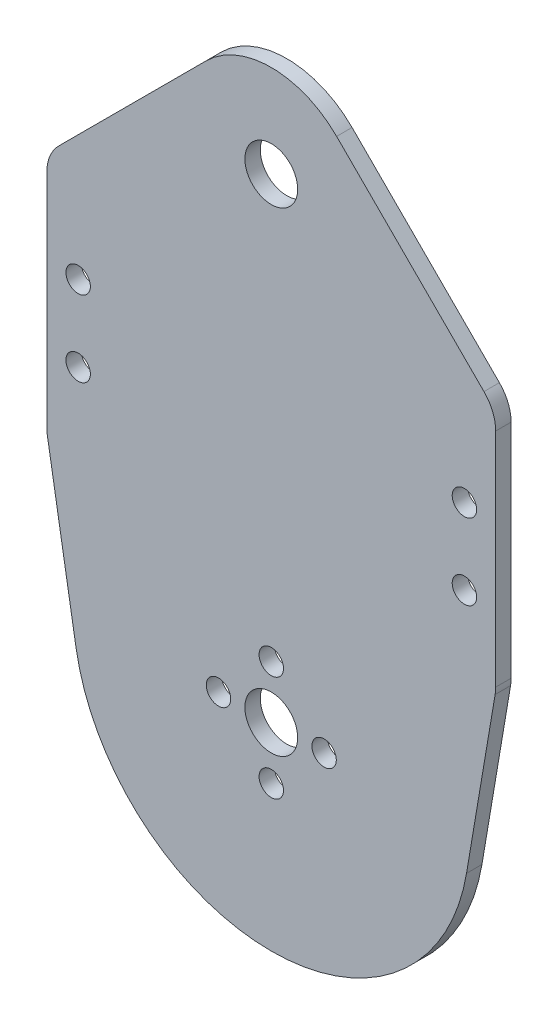
ISO-10303-21;
HEADER;
FILE_DESCRIPTION(('STEP AP214'),'2;1');
FILE_NAME('part.step','',(''),(''),'','','');
FILE_SCHEMA(('AUTOMOTIVE_DESIGN { 1 0 10303 214 1 1 1 1 }'));
ENDSEC;
DATA;
#1=APPLICATION_CONTEXT('core data for automotive mechanical design processes');
#2=APPLICATION_PROTOCOL_DEFINITION('international standard','automotive_design',2000,#1);
#3=PRODUCT_CONTEXT('',#1,'mechanical');
#4=PRODUCT('Part','Part','',(#3));
#5=PRODUCT_RELATED_PRODUCT_CATEGORY('part','',(#4));
#6=PRODUCT_DEFINITION_FORMATION('','',#4);
#7=PRODUCT_DEFINITION_CONTEXT('part definition',#1,'design');
#8=PRODUCT_DEFINITION('design','',#6,#7);
#9=PRODUCT_DEFINITION_SHAPE('','',#8);
#10=(LENGTH_UNIT() NAMED_UNIT(*) SI_UNIT(.MILLI.,.METRE.));
#11=(NAMED_UNIT(*) PLANE_ANGLE_UNIT() SI_UNIT($,.RADIAN.));
#12=(NAMED_UNIT(*) SI_UNIT($,.STERADIAN.) SOLID_ANGLE_UNIT());
#13=UNCERTAINTY_MEASURE_WITH_UNIT(LENGTH_MEASURE(1.E-05),#10,'distance_accuracy_value','');
#14=(GEOMETRIC_REPRESENTATION_CONTEXT(3) GLOBAL_UNCERTAINTY_ASSIGNED_CONTEXT((#13)) GLOBAL_UNIT_ASSIGNED_CONTEXT((#10,
#11,#12)) REPRESENTATION_CONTEXT('',''));
#15=CARTESIAN_POINT('',(0.,0.,0.));
#16=DIRECTION('',(0.,0.,1.));
#17=DIRECTION('',(1.,0.,0.));
#18=AXIS2_PLACEMENT_3D('',#15,#16,#17);
#19=CARTESIAN_POINT('',(-27.936254688423,55.2473043263916,2.3368));
#20=DIRECTION('',(0.,0.,1.));
#21=DIRECTION('',(1.,0.,0.));
#22=AXIS2_PLACEMENT_3D('',#19,#20,#21);
#23=PLANE('',#22);
#24=CARTESIAN_POINT('',(-29.2625000000001,43.5,2.3368));
#25=DIRECTION('',(0.,0.,1.));
#26=DIRECTION('',(1.,0.,0.));
#27=AXIS2_PLACEMENT_3D('',#24,#25,#26);
#28=CIRCLE('',#27,1.85);
#29=CARTESIAN_POINT('',(-27.4125000000001,43.5,2.3368));
#30=VERTEX_POINT('',#29);
#31=EDGE_CURVE('E315',#30,#30,#28,.T.);
#32=ORIENTED_EDGE('',*,*,#31,.F.);
#33=EDGE_LOOP('',(#32));
#34=FACE_BOUND('',#33,.T.);
#35=CARTESIAN_POINT('',(29.2625,32.,2.3368));
#36=DIRECTION('',(0.,0.,1.));
#37=DIRECTION('',(1.,0.,0.));
#38=AXIS2_PLACEMENT_3D('',#35,#36,#37);
#39=CIRCLE('',#38,1.85);
#40=CARTESIAN_POINT('',(31.1125000000001,32.,2.3368));
#41=VERTEX_POINT('',#40);
#42=EDGE_CURVE('E327',#41,#41,#39,.T.);
#43=ORIENTED_EDGE('',*,*,#42,.F.);
#44=EDGE_LOOP('',(#43));
#45=FACE_BOUND('',#44,.T.);
#46=CARTESIAN_POINT('',(0.,-8.,2.3368));
#47=DIRECTION('',(0.,0.,1.));
#48=DIRECTION('',(1.,0.,0.));
#49=AXIS2_PLACEMENT_3D('',#46,#47,#48);
#50=CIRCLE('',#49,1.85);
#51=CARTESIAN_POINT('',(1.85,-8.,2.3368));
#52=VERTEX_POINT('',#51);
#53=EDGE_CURVE('E339',#52,#52,#50,.T.);
#54=ORIENTED_EDGE('',*,*,#53,.F.);
#55=EDGE_LOOP('',(#54));
#56=FACE_BOUND('',#55,.T.);
#57=CARTESIAN_POINT('',(0.,8.,2.3368));
#58=DIRECTION('',(0.,0.,1.));
#59=DIRECTION('',(1.,0.,0.));
#60=AXIS2_PLACEMENT_3D('',#57,#58,#59);
#61=CIRCLE('',#60,1.85);
#62=CARTESIAN_POINT('',(1.85,8.,2.3368));
#63=VERTEX_POINT('',#62);
#64=EDGE_CURVE('E351',#63,#63,#61,.T.);
#65=ORIENTED_EDGE('',*,*,#64,.F.);
#66=EDGE_LOOP('',(#65));
#67=FACE_BOUND('',#66,.T.);
#68=CARTESIAN_POINT('',(29.2625000000001,43.5,2.3368));
#69=DIRECTION('',(0.,0.,1.));
#70=DIRECTION('',(1.,0.,0.));
#71=AXIS2_PLACEMENT_3D('',#68,#69,#70);
#72=CIRCLE('',#71,1.85);
#73=CARTESIAN_POINT('',(31.1125000000001,43.5,2.3368));
#74=VERTEX_POINT('',#73);
#75=EDGE_CURVE('E158',#74,#74,#72,.T.);
#76=ORIENTED_EDGE('',*,*,#75,.F.);
#77=EDGE_LOOP('',(#76));
#78=FACE_BOUND('',#77,.T.);
#79=CARTESIAN_POINT('',(-27.936254688423,55.2473043263916,2.3368));
#80=DIRECTION('',(0.,0.,1.));
#81=DIRECTION('',(1.,0.,0.));
#82=AXIS2_PLACEMENT_3D('',#79,#80,#81);
#83=CIRCLE('',#82,6.06374531157693);
#84=CARTESIAN_POINT('',(-32.2239701176272,59.5350197555958,2.3368));
#85=VERTEX_POINT('',#84);
#86=CARTESIAN_POINT('',(-33.9999999999999,55.2473043263916,2.3368));
#87=VERTEX_POINT('',#86);
#88=EDGE_CURVE('E177',#85,#87,#83,.T.);
#89=ORIENTED_EDGE('',*,*,#88,.T.);
#90=DIRECTION('',(0.,-1.,0.));
#91=VECTOR('',#90,1.);
#92=CARTESIAN_POINT('',(-34.,21.6405384480173,2.3368));
#93=LINE('',#92,#91);
#94=CARTESIAN_POINT('',(-34.,21.6405384480173,2.3368));
#95=VERTEX_POINT('',#94);
#96=EDGE_CURVE('E105',#87,#95,#93,.T.);
#97=ORIENTED_EDGE('',*,*,#96,.T.);
#98=CARTESIAN_POINT('',(-27.936254688423,21.6405384480173,2.3368));
#99=DIRECTION('',(0.,0.,1.));
#100=DIRECTION('',(1.,0.,0.));
#101=AXIS2_PLACEMENT_3D('',#98,#99,#100);
#102=CIRCLE('',#101,6.06374531157696);
#103=CARTESIAN_POINT('',(-33.9150906830899,20.6293375023359,2.3368));
#104=VERTEX_POINT('',#103);
#105=EDGE_CURVE('E204',#95,#104,#102,.T.);
#106=ORIENTED_EDGE('',*,*,#105,.T.);
#107=DIRECTION('',(0.166761777370622,-0.985997215821724,0.));
#108=VECTOR('',#107,1.);
#109=CARTESIAN_POINT('',(-29.5799164746517,-5.00285332111866,2.3368));
#110=LINE('',#109,#108);
#111=CARTESIAN_POINT('',(-29.5799164746517,-5.00285332111866,2.3368));
#112=VERTEX_POINT('',#111);
#113=EDGE_CURVE('E223',#104,#112,#110,.T.);
#114=ORIENTED_EDGE('',*,*,#113,.T.);
#115=CARTESIAN_POINT('',(0.,0.,2.3368));
#116=DIRECTION('',(0.,0.,1.));
#117=DIRECTION('',(1.,0.,0.));
#118=AXIS2_PLACEMENT_3D('',#115,#116,#117);
#119=CIRCLE('',#118,30.);
#120=CARTESIAN_POINT('',(29.5799164746517,-5.00285332111875,2.3368));
#121=VERTEX_POINT('',#120);
#122=EDGE_CURVE('E220',#112,#121,#119,.T.);
#123=ORIENTED_EDGE('',*,*,#122,.T.);
#124=DIRECTION('',(0.166761777370625,0.985997215821723,0.));
#125=VECTOR('',#124,1.);
#126=CARTESIAN_POINT('',(29.5799164746517,-5.00285332111874,2.3368));
#127=LINE('',#126,#125);
#128=CARTESIAN_POINT('',(33.91509068309,20.6293375023359,2.3368));
#129=VERTEX_POINT('',#128);
#130=EDGE_CURVE('E222',#121,#129,#127,.T.);
#131=ORIENTED_EDGE('',*,*,#130,.T.);
#132=CARTESIAN_POINT('',(27.9362546884231,21.6405384480172,2.3368));
#133=DIRECTION('',(0.,0.,1.));
#134=DIRECTION('',(1.,0.,0.));
#135=AXIS2_PLACEMENT_3D('',#132,#133,#134);
#136=CIRCLE('',#135,6.06374531157695);
#137=CARTESIAN_POINT('',(34.,21.6405384480172,2.3368));
#138=VERTEX_POINT('',#137);
#139=EDGE_CURVE('E225',#129,#138,#136,.T.);
#140=ORIENTED_EDGE('',*,*,#139,.T.);
#141=DIRECTION('',(0.,1.,0.));
#142=VECTOR('',#141,1.);
#143=CARTESIAN_POINT('',(34.,21.6405384480172,2.3368));
#144=LINE('',#143,#142);
#145=CARTESIAN_POINT('',(34.0000000000001,55.2473043263916,2.3368));
#146=VERTEX_POINT('',#145);
#147=EDGE_CURVE('E231',#138,#146,#144,.T.);
#148=ORIENTED_EDGE('',*,*,#147,.T.);
#149=CARTESIAN_POINT('',(27.9362546884231,55.2473043263916,2.3368));
#150=DIRECTION('',(0.,0.,1.));
#151=DIRECTION('',(1.,0.,0.));
#152=AXIS2_PLACEMENT_3D('',#149,#150,#151);
#153=CIRCLE('',#152,6.06374531157696);
#154=CARTESIAN_POINT('',(32.2239701176273,59.5350197555958,2.3368));
#155=VERTEX_POINT('',#154);
#156=EDGE_CURVE('E136',#146,#155,#153,.T.);
#157=ORIENTED_EDGE('',*,*,#156,.T.);
#158=DIRECTION('',(-0.707106781186544,0.707106781186551,0.));
#159=VECTOR('',#158,1.);
#160=CARTESIAN_POINT('',(32.2239701176273,59.5350197555958,2.3368));
#161=LINE('',#160,#159);
#162=CARTESIAN_POINT('',(9.89949493661178,81.8594949366116,2.3368));
#163=VERTEX_POINT('',#162);
#164=EDGE_CURVE('E130',#155,#163,#161,.T.);
#165=ORIENTED_EDGE('',*,*,#164,.T.);
#166=CARTESIAN_POINT('',(0.,71.96,2.3368));
#167=DIRECTION('',(0.,0.,1.));
#168=DIRECTION('',(1.,0.,0.));
#169=AXIS2_PLACEMENT_3D('',#166,#167,#168);
#170=CIRCLE('',#169,14.);
#171=CARTESIAN_POINT('',(-9.89949493661165,81.8594949366116,2.3368));
#172=VERTEX_POINT('',#171);
#173=EDGE_CURVE('E134',#163,#172,#170,.T.);
#174=ORIENTED_EDGE('',*,*,#173,.T.);
#175=DIRECTION('',(-0.707106781186544,-0.707106781186551,0.));
#176=VECTOR('',#175,1.);
#177=CARTESIAN_POINT('',(-9.89949493661165,81.8594949366116,2.3368));
#178=LINE('',#177,#176);
#179=EDGE_CURVE('E50',#172,#85,#178,.T.);
#180=ORIENTED_EDGE('',*,*,#179,.T.);
#181=EDGE_LOOP('',(#89,#97,#106,#114,#123,#131,#140,#148,#157,#165,#174,#180));
#182=FACE_BOUND('',#181,.T.);
#183=CARTESIAN_POINT('',(0.,0.,2.3368));
#184=DIRECTION('',(0.,0.,1.));
#185=DIRECTION('',(1.,0.,0.));
#186=AXIS2_PLACEMENT_3D('',#183,#184,#185);
#187=CIRCLE('',#186,4.);
#188=CARTESIAN_POINT('',(4.,0.,2.3368));
#189=VERTEX_POINT('',#188);
#190=EDGE_CURVE('E357',#189,#189,#187,.T.);
#191=ORIENTED_EDGE('',*,*,#190,.F.);
#192=EDGE_LOOP('',(#191));
#193=FACE_BOUND('',#192,.T.);
#194=CARTESIAN_POINT('',(-8.,0.,2.3368));
#195=DIRECTION('',(0.,0.,1.));
#196=DIRECTION('',(1.,0.,0.));
#197=AXIS2_PLACEMENT_3D('',#194,#195,#196);
#198=CIRCLE('',#197,1.85);
#199=CARTESIAN_POINT('',(-6.15,0.,2.3368));
#200=VERTEX_POINT('',#199);
#201=EDGE_CURVE('E345',#200,#200,#198,.T.);
#202=ORIENTED_EDGE('',*,*,#201,.F.);
#203=EDGE_LOOP('',(#202));
#204=FACE_BOUND('',#203,.T.);
#205=CARTESIAN_POINT('',(8.,0.,2.3368));
#206=DIRECTION('',(0.,0.,1.));
#207=DIRECTION('',(1.,0.,0.));
#208=AXIS2_PLACEMENT_3D('',#205,#206,#207);
#209=CIRCLE('',#208,1.85);
#210=CARTESIAN_POINT('',(9.85,0.,2.3368));
#211=VERTEX_POINT('',#210);
#212=EDGE_CURVE('E333',#211,#211,#209,.T.);
#213=ORIENTED_EDGE('',*,*,#212,.F.);
#214=EDGE_LOOP('',(#213));
#215=FACE_BOUND('',#214,.T.);
#216=CARTESIAN_POINT('',(0.,71.96,2.3368));
#217=DIRECTION('',(0.,0.,1.));
#218=DIRECTION('',(1.,0.,0.));
#219=AXIS2_PLACEMENT_3D('',#216,#217,#218);
#220=CIRCLE('',#219,4.);
#221=CARTESIAN_POINT('',(4.00000000000005,71.96,2.3368));
#222=VERTEX_POINT('',#221);
#223=EDGE_CURVE('E321',#222,#222,#220,.T.);
#224=ORIENTED_EDGE('',*,*,#223,.F.);
#225=EDGE_LOOP('',(#224));
#226=FACE_BOUND('',#225,.T.);
#227=CARTESIAN_POINT('',(-29.2625000000001,32.,2.3368));
#228=DIRECTION('',(0.,0.,1.));
#229=DIRECTION('',(1.,0.,0.));
#230=AXIS2_PLACEMENT_3D('',#227,#228,#229);
#231=CIRCLE('',#230,1.85);
#232=CARTESIAN_POINT('',(-27.4125000000001,32.,2.3368));
#233=VERTEX_POINT('',#232);
#234=EDGE_CURVE('E306',#233,#233,#231,.T.);
#235=ORIENTED_EDGE('',*,*,#234,.F.);
#236=EDGE_LOOP('',(#235));
#237=FACE_BOUND('',#236,.T.);
#238=ADVANCED_FACE('F33',(#34,#45,#56,#67,#78,#182,#193,#204,#215,#226,#237),#23,.T.);
#239=CARTESIAN_POINT('',(-27.936254688423,55.2473043263916,0.));
#240=DIRECTION('',(0.,0.,1.));
#241=DIRECTION('',(1.,0.,0.));
#242=AXIS2_PLACEMENT_3D('',#239,#240,#241);
#243=PLANE('',#242);
#244=CARTESIAN_POINT('',(-27.936254688423,55.2473043263916,0.));
#245=DIRECTION('',(0.,0.,1.));
#246=DIRECTION('',(1.,0.,0.));
#247=AXIS2_PLACEMENT_3D('',#244,#245,#246);
#248=CIRCLE('',#247,6.06374531157693);
#249=CARTESIAN_POINT('',(-32.2239701176272,59.5350197555958,0.));
#250=VERTEX_POINT('',#249);
#251=CARTESIAN_POINT('',(-33.9999999999999,55.2473043263916,0.));
#252=VERTEX_POINT('',#251);
#253=EDGE_CURVE('E154',#250,#252,#248,.T.);
#254=ORIENTED_EDGE('',*,*,#253,.F.);
#255=DIRECTION('',(-0.707106781186544,-0.707106781186551,0.));
#256=VECTOR('',#255,1.);
#257=CARTESIAN_POINT('',(-9.89949493661165,81.8594949366116,0.));
#258=LINE('',#257,#256);
#259=CARTESIAN_POINT('',(-9.89949493661165,81.8594949366116,0.));
#260=VERTEX_POINT('',#259);
#261=EDGE_CURVE('E97',#260,#250,#258,.T.);
#262=ORIENTED_EDGE('',*,*,#261,.F.);
#263=CARTESIAN_POINT('',(0.,71.96,0.));
#264=DIRECTION('',(0.,0.,1.));
#265=DIRECTION('',(1.,0.,0.));
#266=AXIS2_PLACEMENT_3D('',#263,#264,#265);
#267=CIRCLE('',#266,14.);
#268=CARTESIAN_POINT('',(9.89949493661178,81.8594949366116,0.));
#269=VERTEX_POINT('',#268);
#270=EDGE_CURVE('E91',#269,#260,#267,.T.);
#271=ORIENTED_EDGE('',*,*,#270,.F.);
#272=DIRECTION('',(-0.707106781186544,0.707106781186551,0.));
#273=VECTOR('',#272,1.);
#274=CARTESIAN_POINT('',(32.2239701176273,59.5350197555958,0.));
#275=LINE('',#274,#273);
#276=CARTESIAN_POINT('',(32.2239701176273,59.5350197555958,0.));
#277=VERTEX_POINT('',#276);
#278=EDGE_CURVE('E144',#277,#269,#275,.T.);
#279=ORIENTED_EDGE('',*,*,#278,.F.);
#280=CARTESIAN_POINT('',(27.9362546884231,55.2473043263916,0.));
#281=DIRECTION('',(0.,0.,1.));
#282=DIRECTION('',(1.,0.,0.));
#283=AXIS2_PLACEMENT_3D('',#280,#281,#282);
#284=CIRCLE('',#283,6.06374531157696);
#285=CARTESIAN_POINT('',(34.0000000000001,55.2473043263916,0.));
#286=VERTEX_POINT('',#285);
#287=EDGE_CURVE('E172',#286,#277,#284,.T.);
#288=ORIENTED_EDGE('',*,*,#287,.F.);
#289=DIRECTION('',(0.,1.,0.));
#290=VECTOR('',#289,1.);
#291=CARTESIAN_POINT('',(34.,21.6405384480172,0.));
#292=LINE('',#291,#290);
#293=CARTESIAN_POINT('',(34.,21.6405384480172,0.));
#294=VERTEX_POINT('',#293);
#295=EDGE_CURVE('E170',#294,#286,#292,.T.);
#296=ORIENTED_EDGE('',*,*,#295,.F.);
#297=CARTESIAN_POINT('',(27.9362546884231,21.6405384480172,0.));
#298=DIRECTION('',(0.,0.,1.));
#299=DIRECTION('',(1.,0.,0.));
#300=AXIS2_PLACEMENT_3D('',#297,#298,#299);
#301=CIRCLE('',#300,6.06374531157695);
#302=CARTESIAN_POINT('',(33.91509068309,20.6293375023359,0.));
#303=VERTEX_POINT('',#302);
#304=EDGE_CURVE('E168',#303,#294,#301,.T.);
#305=ORIENTED_EDGE('',*,*,#304,.F.);
#306=DIRECTION('',(0.166761777370625,0.985997215821723,0.));
#307=VECTOR('',#306,1.);
#308=CARTESIAN_POINT('',(29.5799164746517,-5.00285332111874,0.));
#309=LINE('',#308,#307);
#310=CARTESIAN_POINT('',(29.5799164746517,-5.00285332111875,0.));
#311=VERTEX_POINT('',#310);
#312=EDGE_CURVE('E166',#311,#303,#309,.T.);
#313=ORIENTED_EDGE('',*,*,#312,.F.);
#314=CARTESIAN_POINT('',(0.,0.,0.));
#315=DIRECTION('',(0.,0.,1.));
#316=DIRECTION('',(1.,0.,0.));
#317=AXIS2_PLACEMENT_3D('',#314,#315,#316);
#318=CIRCLE('',#317,30.);
#319=CARTESIAN_POINT('',(-29.5799164746517,-5.00285332111866,0.));
#320=VERTEX_POINT('',#319);
#321=EDGE_CURVE('E164',#320,#311,#318,.T.);
#322=ORIENTED_EDGE('',*,*,#321,.F.);
#323=DIRECTION('',(0.166761777370622,-0.985997215821724,0.));
#324=VECTOR('',#323,1.);
#325=CARTESIAN_POINT('',(-29.5799164746517,-5.00285332111866,0.));
#326=LINE('',#325,#324);
#327=CARTESIAN_POINT('',(-33.9150906830899,20.6293375023359,0.));
#328=VERTEX_POINT('',#327);
#329=EDGE_CURVE('E162',#328,#320,#326,.T.);
#330=ORIENTED_EDGE('',*,*,#329,.F.);
#331=CARTESIAN_POINT('',(-27.936254688423,21.6405384480173,0.));
#332=DIRECTION('',(0.,0.,1.));
#333=DIRECTION('',(1.,0.,0.));
#334=AXIS2_PLACEMENT_3D('',#331,#332,#333);
#335=CIRCLE('',#334,6.06374531157696);
#336=CARTESIAN_POINT('',(-34.,21.6405384480173,0.));
#337=VERTEX_POINT('',#336);
#338=EDGE_CURVE('E160',#337,#328,#335,.T.);
#339=ORIENTED_EDGE('',*,*,#338,.F.);
#340=DIRECTION('',(0.,-1.,0.));
#341=VECTOR('',#340,1.);
#342=CARTESIAN_POINT('',(-34.,21.6405384480173,0.));
#343=LINE('',#342,#341);
#344=EDGE_CURVE('E157',#252,#337,#343,.T.);
#345=ORIENTED_EDGE('',*,*,#344,.F.);
#346=EDGE_LOOP('',(#254,#262,#271,#279,#288,#296,#305,#313,#322,#330,#339,#345));
#347=FACE_BOUND('',#346,.T.);
#348=CARTESIAN_POINT('',(29.2625000000001,43.5,0.));
#349=DIRECTION('',(0.,0.,1.));
#350=DIRECTION('',(1.,0.,0.));
#351=AXIS2_PLACEMENT_3D('',#348,#349,#350);
#352=CIRCLE('',#351,1.85);
#353=CARTESIAN_POINT('',(31.1125000000001,43.5,0.));
#354=VERTEX_POINT('',#353);
#355=EDGE_CURVE('E360',#354,#354,#352,.T.);
#356=ORIENTED_EDGE('',*,*,#355,.T.);
#357=EDGE_LOOP('',(#356));
#358=FACE_BOUND('',#357,.T.);
#359=CARTESIAN_POINT('',(0.,0.,0.));
#360=DIRECTION('',(0.,0.,1.));
#361=DIRECTION('',(1.,0.,0.));
#362=AXIS2_PLACEMENT_3D('',#359,#360,#361);
#363=CIRCLE('',#362,4.);
#364=CARTESIAN_POINT('',(4.,0.,0.));
#365=VERTEX_POINT('',#364);
#366=EDGE_CURVE('E354',#365,#365,#363,.T.);
#367=ORIENTED_EDGE('',*,*,#366,.T.);
#368=EDGE_LOOP('',(#367));
#369=FACE_BOUND('',#368,.T.);
#370=CARTESIAN_POINT('',(0.,8.,0.));
#371=DIRECTION('',(0.,0.,1.));
#372=DIRECTION('',(1.,0.,0.));
#373=AXIS2_PLACEMENT_3D('',#370,#371,#372);
#374=CIRCLE('',#373,1.85);
#375=CARTESIAN_POINT('',(1.85,8.,0.));
#376=VERTEX_POINT('',#375);
#377=EDGE_CURVE('E348',#376,#376,#374,.T.);
#378=ORIENTED_EDGE('',*,*,#377,.T.);
#379=EDGE_LOOP('',(#378));
#380=FACE_BOUND('',#379,.T.);
#381=CARTESIAN_POINT('',(-8.,0.,0.));
#382=DIRECTION('',(0.,0.,1.));
#383=DIRECTION('',(1.,0.,0.));
#384=AXIS2_PLACEMENT_3D('',#381,#382,#383);
#385=CIRCLE('',#384,1.85);
#386=CARTESIAN_POINT('',(-6.15,0.,0.));
#387=VERTEX_POINT('',#386);
#388=EDGE_CURVE('E342',#387,#387,#385,.T.);
#389=ORIENTED_EDGE('',*,*,#388,.T.);
#390=EDGE_LOOP('',(#389));
#391=FACE_BOUND('',#390,.T.);
#392=CARTESIAN_POINT('',(0.,-8.,0.));
#393=DIRECTION('',(0.,0.,1.));
#394=DIRECTION('',(1.,0.,0.));
#395=AXIS2_PLACEMENT_3D('',#392,#393,#394);
#396=CIRCLE('',#395,1.85);
#397=CARTESIAN_POINT('',(1.85,-8.,0.));
#398=VERTEX_POINT('',#397);
#399=EDGE_CURVE('E336',#398,#398,#396,.T.);
#400=ORIENTED_EDGE('',*,*,#399,.T.);
#401=EDGE_LOOP('',(#400));
#402=FACE_BOUND('',#401,.T.);
#403=CARTESIAN_POINT('',(8.,0.,0.));
#404=DIRECTION('',(0.,0.,1.));
#405=DIRECTION('',(1.,0.,0.));
#406=AXIS2_PLACEMENT_3D('',#403,#404,#405);
#407=CIRCLE('',#406,1.85);
#408=CARTESIAN_POINT('',(9.85,0.,0.));
#409=VERTEX_POINT('',#408);
#410=EDGE_CURVE('E330',#409,#409,#407,.T.);
#411=ORIENTED_EDGE('',*,*,#410,.T.);
#412=EDGE_LOOP('',(#411));
#413=FACE_BOUND('',#412,.T.);
#414=CARTESIAN_POINT('',(29.2625,32.,0.));
#415=DIRECTION('',(0.,0.,1.));
#416=DIRECTION('',(1.,0.,0.));
#417=AXIS2_PLACEMENT_3D('',#414,#415,#416);
#418=CIRCLE('',#417,1.85);
#419=CARTESIAN_POINT('',(31.1125000000001,32.,0.));
#420=VERTEX_POINT('',#419);
#421=EDGE_CURVE('E324',#420,#420,#418,.T.);
#422=ORIENTED_EDGE('',*,*,#421,.T.);
#423=EDGE_LOOP('',(#422));
#424=FACE_BOUND('',#423,.T.);
#425=CARTESIAN_POINT('',(0.,71.96,0.));
#426=DIRECTION('',(0.,0.,1.));
#427=DIRECTION('',(1.,0.,0.));
#428=AXIS2_PLACEMENT_3D('',#425,#426,#427);
#429=CIRCLE('',#428,4.);
#430=CARTESIAN_POINT('',(4.00000000000005,71.96,0.));
#431=VERTEX_POINT('',#430);
#432=EDGE_CURVE('E318',#431,#431,#429,.T.);
#433=ORIENTED_EDGE('',*,*,#432,.T.);
#434=EDGE_LOOP('',(#433));
#435=FACE_BOUND('',#434,.T.);
#436=CARTESIAN_POINT('',(-29.2625000000001,43.5,0.));
#437=DIRECTION('',(0.,0.,1.));
#438=DIRECTION('',(1.,0.,0.));
#439=AXIS2_PLACEMENT_3D('',#436,#437,#438);
#440=CIRCLE('',#439,1.85);
#441=CARTESIAN_POINT('',(-27.4125000000001,43.5,0.));
#442=VERTEX_POINT('',#441);
#443=EDGE_CURVE('E312',#442,#442,#440,.T.);
#444=ORIENTED_EDGE('',*,*,#443,.T.);
#445=EDGE_LOOP('',(#444));
#446=FACE_BOUND('',#445,.T.);
#447=CARTESIAN_POINT('',(-29.2625000000001,32.,0.));
#448=DIRECTION('',(0.,0.,1.));
#449=DIRECTION('',(1.,0.,0.));
#450=AXIS2_PLACEMENT_3D('',#447,#448,#449);
#451=CIRCLE('',#450,1.85);
#452=CARTESIAN_POINT('',(-27.4125000000001,32.,0.));
#453=VERTEX_POINT('',#452);
#454=EDGE_CURVE('E309',#453,#453,#451,.T.);
#455=ORIENTED_EDGE('',*,*,#454,.T.);
#456=EDGE_LOOP('',(#455));
#457=FACE_BOUND('',#456,.T.);
#458=ADVANCED_FACE('F208',(#347,#358,#369,#380,#391,#402,#413,#424,#435,#446,#457),#243,.F.);
#459=CARTESIAN_POINT('',(-27.936254688423,55.2473043263916,2.3368));
#460=DIRECTION('',(0.,0.,-1.));
#461=DIRECTION('',(-1.,0.,0.));
#462=AXIS2_PLACEMENT_3D('',#459,#460,#461);
#463=CYLINDRICAL_SURFACE('',#462,6.06374531157693);
#464=ORIENTED_EDGE('',*,*,#253,.T.);
#465=DIRECTION('',(0.,0.,-1.));
#466=VECTOR('',#465,1.);
#467=CARTESIAN_POINT('',(-33.9999999999999,55.2473043263916,2.3368));
#468=LINE('',#467,#466);
#469=EDGE_CURVE('E11',#87,#252,#468,.T.);
#470=ORIENTED_EDGE('',*,*,#469,.F.);
#471=ORIENTED_EDGE('',*,*,#88,.F.);
#472=DIRECTION('',(0.,0.,-1.));
#473=VECTOR('',#472,1.);
#474=CARTESIAN_POINT('',(-32.2239701176272,59.5350197555958,2.3368));
#475=LINE('',#474,#473);
#476=EDGE_CURVE('E150',#85,#250,#475,.T.);
#477=ORIENTED_EDGE('',*,*,#476,.T.);
#478=EDGE_LOOP('',(#464,#470,#471,#477));
#479=FACE_BOUND('',#478,.T.);
#480=ADVANCED_FACE('F35',(#479),#463,.T.);
#481=CARTESIAN_POINT('',(-34.,21.6405384480173,2.3368));
#482=DIRECTION('',(1.,0.,0.));
#483=DIRECTION('',(0.,1.,0.));
#484=AXIS2_PLACEMENT_3D('',#481,#482,#483);
#485=PLANE('',#484);
#486=ORIENTED_EDGE('',*,*,#344,.T.);
#487=DIRECTION('',(0.,0.,-1.));
#488=VECTOR('',#487,1.);
#489=CARTESIAN_POINT('',(-34.,21.6405384480173,2.3368));
#490=LINE('',#489,#488);
#491=EDGE_CURVE('E42',#95,#337,#490,.T.);
#492=ORIENTED_EDGE('',*,*,#491,.F.);
#493=ORIENTED_EDGE('',*,*,#96,.F.);
#494=ORIENTED_EDGE('',*,*,#469,.T.);
#495=EDGE_LOOP('',(#486,#492,#493,#494));
#496=FACE_BOUND('',#495,.T.);
#497=ADVANCED_FACE('F524',(#496),#485,.F.);
#498=CARTESIAN_POINT('',(-27.936254688423,21.6405384480173,2.3368));
#499=DIRECTION('',(0.,0.,-1.));
#500=DIRECTION('',(-1.,0.,0.));
#501=AXIS2_PLACEMENT_3D('',#498,#499,#500);
#502=CYLINDRICAL_SURFACE('',#501,6.06374531157696);
#503=ORIENTED_EDGE('',*,*,#338,.T.);
#504=DIRECTION('',(0.,0.,-1.));
#505=VECTOR('',#504,1.);
#506=CARTESIAN_POINT('',(-33.9150906830899,20.6293375023359,2.3368));
#507=LINE('',#506,#505);
#508=EDGE_CURVE('E196',#104,#328,#507,.T.);
#509=ORIENTED_EDGE('',*,*,#508,.F.);
#510=ORIENTED_EDGE('',*,*,#105,.F.);
#511=ORIENTED_EDGE('',*,*,#491,.T.);
#512=EDGE_LOOP('',(#503,#509,#510,#511));
#513=FACE_BOUND('',#512,.T.);
#514=ADVANCED_FACE('F202',(#513),#502,.T.);
#515=CARTESIAN_POINT('',(-29.5799164746517,-5.00285332111866,2.3368));
#516=DIRECTION('',(0.985997215821724,0.166761777370622,0.));
#517=DIRECTION('',(-0.166761777370622,0.985997215821724,0.));
#518=AXIS2_PLACEMENT_3D('',#515,#516,#517);
#519=PLANE('',#518);
#520=ORIENTED_EDGE('',*,*,#329,.T.);
#521=DIRECTION('',(0.,0.,-1.));
#522=VECTOR('',#521,1.);
#523=CARTESIAN_POINT('',(-29.5799164746517,-5.00285332111866,2.3368));
#524=LINE('',#523,#522);
#525=EDGE_CURVE('E193',#112,#320,#524,.T.);
#526=ORIENTED_EDGE('',*,*,#525,.F.);
#527=ORIENTED_EDGE('',*,*,#113,.F.);
#528=ORIENTED_EDGE('',*,*,#508,.T.);
#529=EDGE_LOOP('',(#520,#526,#527,#528));
#530=FACE_BOUND('',#529,.T.);
#531=ADVANCED_FACE('F214',(#530),#519,.F.);
#532=CARTESIAN_POINT('',(0.,0.,2.3368));
#533=DIRECTION('',(0.,0.,-1.));
#534=DIRECTION('',(-1.,0.,0.));
#535=AXIS2_PLACEMENT_3D('',#532,#533,#534);
#536=CYLINDRICAL_SURFACE('',#535,30.);
#537=ORIENTED_EDGE('',*,*,#321,.T.);
#538=DIRECTION('',(0.,0.,-1.));
#539=VECTOR('',#538,1.);
#540=CARTESIAN_POINT('',(29.5799164746517,-5.00285332111875,2.3368));
#541=LINE('',#540,#539);
#542=EDGE_CURVE('E190',#121,#311,#541,.T.);
#543=ORIENTED_EDGE('',*,*,#542,.F.);
#544=ORIENTED_EDGE('',*,*,#122,.F.);
#545=ORIENTED_EDGE('',*,*,#525,.T.);
#546=EDGE_LOOP('',(#537,#543,#544,#545));
#547=FACE_BOUND('',#546,.T.);
#548=ADVANCED_FACE('F218',(#547),#536,.T.);
#549=CARTESIAN_POINT('',(29.5799164746517,-5.00285332111874,2.3368));
#550=DIRECTION('',(-0.985997215821724,0.166761777370625,0.));
#551=DIRECTION('',(-0.166761777370625,-0.985997215821724,0.));
#552=AXIS2_PLACEMENT_3D('',#549,#550,#551);
#553=PLANE('',#552);
#554=ORIENTED_EDGE('',*,*,#312,.T.);
#555=DIRECTION('',(0.,0.,-1.));
#556=VECTOR('',#555,1.);
#557=CARTESIAN_POINT('',(33.91509068309,20.6293375023359,2.3368));
#558=LINE('',#557,#556);
#559=EDGE_CURVE('E187',#129,#303,#558,.T.);
#560=ORIENTED_EDGE('',*,*,#559,.F.);
#561=ORIENTED_EDGE('',*,*,#130,.F.);
#562=ORIENTED_EDGE('',*,*,#542,.T.);
#563=EDGE_LOOP('',(#554,#560,#561,#562));
#564=FACE_BOUND('',#563,.T.);
#565=ADVANCED_FACE('F489',(#564),#553,.F.);
#566=CARTESIAN_POINT('',(27.9362546884231,21.6405384480172,2.3368));
#567=DIRECTION('',(0.,0.,-1.));
#568=DIRECTION('',(-1.,0.,0.));
#569=AXIS2_PLACEMENT_3D('',#566,#567,#568);
#570=CYLINDRICAL_SURFACE('',#569,6.06374531157695);
#571=ORIENTED_EDGE('',*,*,#304,.T.);
#572=DIRECTION('',(0.,0.,-1.));
#573=VECTOR('',#572,1.);
#574=CARTESIAN_POINT('',(34.,21.6405384480172,2.3368));
#575=LINE('',#574,#573);
#576=EDGE_CURVE('E184',#138,#294,#575,.T.);
#577=ORIENTED_EDGE('',*,*,#576,.F.);
#578=ORIENTED_EDGE('',*,*,#139,.F.);
#579=ORIENTED_EDGE('',*,*,#559,.T.);
#580=EDGE_LOOP('',(#571,#577,#578,#579));
#581=FACE_BOUND('',#580,.T.);
#582=ADVANCED_FACE('F480',(#581),#570,.T.);
#583=CARTESIAN_POINT('',(34.,21.6405384480172,2.3368));
#584=DIRECTION('',(-1.,0.,0.));
#585=DIRECTION('',(0.,-1.,0.));
#586=AXIS2_PLACEMENT_3D('',#583,#584,#585);
#587=PLANE('',#586);
#588=ORIENTED_EDGE('',*,*,#295,.T.);
#589=DIRECTION('',(0.,0.,-1.));
#590=VECTOR('',#589,1.);
#591=CARTESIAN_POINT('',(34.0000000000001,55.2473043263916,2.3368));
#592=LINE('',#591,#590);
#593=EDGE_CURVE('E181',#146,#286,#592,.T.);
#594=ORIENTED_EDGE('',*,*,#593,.F.);
#595=ORIENTED_EDGE('',*,*,#147,.F.);
#596=ORIENTED_EDGE('',*,*,#576,.T.);
#597=EDGE_LOOP('',(#588,#594,#595,#596));
#598=FACE_BOUND('',#597,.T.);
#599=ADVANCED_FACE('F237',(#598),#587,.F.);
#600=CARTESIAN_POINT('',(27.9362546884231,55.2473043263916,2.3368));
#601=DIRECTION('',(0.,0.,-1.));
#602=DIRECTION('',(-1.,0.,0.));
#603=AXIS2_PLACEMENT_3D('',#600,#601,#602);
#604=CYLINDRICAL_SURFACE('',#603,6.06374531157696);
#605=ORIENTED_EDGE('',*,*,#287,.T.);
#606=DIRECTION('',(0.,0.,-1.));
#607=VECTOR('',#606,1.);
#608=CARTESIAN_POINT('',(32.2239701176273,59.5350197555958,2.3368));
#609=LINE('',#608,#607);
#610=EDGE_CURVE('E145',#155,#277,#609,.T.);
#611=ORIENTED_EDGE('',*,*,#610,.F.);
#612=ORIENTED_EDGE('',*,*,#156,.F.);
#613=ORIENTED_EDGE('',*,*,#593,.T.);
#614=EDGE_LOOP('',(#605,#611,#612,#613));
#615=FACE_BOUND('',#614,.T.);
#616=ADVANCED_FACE('F241',(#615),#604,.T.);
#617=CARTESIAN_POINT('',(32.2239701176273,59.5350197555958,2.3368));
#618=DIRECTION('',(-0.707106781186551,-0.707106781186544,0.));
#619=DIRECTION('',(0.707106781186544,-0.707106781186551,0.));
#620=AXIS2_PLACEMENT_3D('',#617,#618,#619);
#621=PLANE('',#620);
#622=ORIENTED_EDGE('',*,*,#278,.T.);
#623=DIRECTION('',(0.,0.,-1.));
#624=VECTOR('',#623,1.);
#625=CARTESIAN_POINT('',(9.89949493661178,81.8594949366116,2.3368));
#626=LINE('',#625,#624);
#627=EDGE_CURVE('E141',#163,#269,#626,.T.);
#628=ORIENTED_EDGE('',*,*,#627,.F.);
#629=ORIENTED_EDGE('',*,*,#164,.F.);
#630=ORIENTED_EDGE('',*,*,#610,.T.);
#631=EDGE_LOOP('',(#622,#628,#629,#630));
#632=FACE_BOUND('',#631,.T.);
#633=ADVANCED_FACE('F142',(#632),#621,.F.);
#634=CARTESIAN_POINT('',(0.,71.96,2.3368));
#635=DIRECTION('',(0.,0.,-1.));
#636=DIRECTION('',(-1.,0.,0.));
#637=AXIS2_PLACEMENT_3D('',#634,#635,#636);
#638=CYLINDRICAL_SURFACE('',#637,14.);
#639=ORIENTED_EDGE('',*,*,#270,.T.);
#640=DIRECTION('',(0.,0.,-1.));
#641=VECTOR('',#640,1.);
#642=CARTESIAN_POINT('',(-9.89949493661165,81.8594949366116,2.3368));
#643=LINE('',#642,#641);
#644=EDGE_CURVE('E146',#172,#260,#643,.T.);
#645=ORIENTED_EDGE('',*,*,#644,.F.);
#646=ORIENTED_EDGE('',*,*,#173,.F.);
#647=ORIENTED_EDGE('',*,*,#627,.T.);
#648=EDGE_LOOP('',(#639,#645,#646,#647));
#649=FACE_BOUND('',#648,.T.);
#650=ADVANCED_FACE('F148',(#649),#638,.T.);
#651=CARTESIAN_POINT('',(-9.89949493661165,81.8594949366116,2.3368));
#652=DIRECTION('',(0.707106781186551,-0.707106781186544,0.));
#653=DIRECTION('',(0.707106781186544,0.707106781186551,0.));
#654=AXIS2_PLACEMENT_3D('',#651,#652,#653);
#655=PLANE('',#654);
#656=ORIENTED_EDGE('',*,*,#261,.T.);
#657=ORIENTED_EDGE('',*,*,#476,.F.);
#658=ORIENTED_EDGE('',*,*,#179,.F.);
#659=ORIENTED_EDGE('',*,*,#644,.T.);
#660=EDGE_LOOP('',(#656,#657,#658,#659));
#661=FACE_BOUND('',#660,.T.);
#662=ADVANCED_FACE('F245',(#661),#655,.F.);
#663=CARTESIAN_POINT('',(29.2625000000001,43.5,2.3368));
#664=DIRECTION('',(0.,0.,-1.));
#665=DIRECTION('',(-1.,0.,0.));
#666=AXIS2_PLACEMENT_3D('',#663,#664,#665);
#667=CYLINDRICAL_SURFACE('',#666,1.85);
#668=ORIENTED_EDGE('',*,*,#75,.T.);
#669=EDGE_LOOP('',(#668));
#670=FACE_BOUND('',#669,.T.);
#671=ORIENTED_EDGE('',*,*,#355,.F.);
#672=EDGE_LOOP('',(#671));
#673=FACE_BOUND('',#672,.T.);
#674=ADVANCED_FACE('F247',(#670,#673),#667,.F.);
#675=CARTESIAN_POINT('',(0.,0.,2.3368));
#676=DIRECTION('',(0.,0.,-1.));
#677=DIRECTION('',(-1.,0.,0.));
#678=AXIS2_PLACEMENT_3D('',#675,#676,#677);
#679=CYLINDRICAL_SURFACE('',#678,4.);
#680=ORIENTED_EDGE('',*,*,#190,.T.);
#681=EDGE_LOOP('',(#680));
#682=FACE_BOUND('',#681,.T.);
#683=ORIENTED_EDGE('',*,*,#366,.F.);
#684=EDGE_LOOP('',(#683));
#685=FACE_BOUND('',#684,.T.);
#686=ADVANCED_FACE('F253',(#682,#685),#679,.F.);
#687=CARTESIAN_POINT('',(0.,8.,2.3368));
#688=DIRECTION('',(0.,0.,-1.));
#689=DIRECTION('',(-1.,0.,0.));
#690=AXIS2_PLACEMENT_3D('',#687,#688,#689);
#691=CYLINDRICAL_SURFACE('',#690,1.85);
#692=ORIENTED_EDGE('',*,*,#64,.T.);
#693=EDGE_LOOP('',(#692));
#694=FACE_BOUND('',#693,.T.);
#695=ORIENTED_EDGE('',*,*,#377,.F.);
#696=EDGE_LOOP('',(#695));
#697=FACE_BOUND('',#696,.T.);
#698=ADVANCED_FACE('F269',(#694,#697),#691,.F.);
#699=CARTESIAN_POINT('',(-8.,0.,2.3368));
#700=DIRECTION('',(0.,0.,-1.));
#701=DIRECTION('',(-1.,0.,0.));
#702=AXIS2_PLACEMENT_3D('',#699,#700,#701);
#703=CYLINDRICAL_SURFACE('',#702,1.85);
#704=ORIENTED_EDGE('',*,*,#201,.T.);
#705=EDGE_LOOP('',(#704));
#706=FACE_BOUND('',#705,.T.);
#707=ORIENTED_EDGE('',*,*,#388,.F.);
#708=EDGE_LOOP('',(#707));
#709=FACE_BOUND('',#708,.T.);
#710=ADVANCED_FACE('F273',(#706,#709),#703,.F.);
#711=CARTESIAN_POINT('',(0.,-8.,2.3368));
#712=DIRECTION('',(0.,0.,-1.));
#713=DIRECTION('',(-1.,0.,0.));
#714=AXIS2_PLACEMENT_3D('',#711,#712,#713);
#715=CYLINDRICAL_SURFACE('',#714,1.85);
#716=ORIENTED_EDGE('',*,*,#53,.T.);
#717=EDGE_LOOP('',(#716));
#718=FACE_BOUND('',#717,.T.);
#719=ORIENTED_EDGE('',*,*,#399,.F.);
#720=EDGE_LOOP('',(#719));
#721=FACE_BOUND('',#720,.T.);
#722=ADVANCED_FACE('F277',(#718,#721),#715,.F.);
#723=CARTESIAN_POINT('',(8.,0.,2.3368));
#724=DIRECTION('',(0.,0.,-1.));
#725=DIRECTION('',(-1.,0.,0.));
#726=AXIS2_PLACEMENT_3D('',#723,#724,#725);
#727=CYLINDRICAL_SURFACE('',#726,1.85);
#728=ORIENTED_EDGE('',*,*,#212,.T.);
#729=EDGE_LOOP('',(#728));
#730=FACE_BOUND('',#729,.T.);
#731=ORIENTED_EDGE('',*,*,#410,.F.);
#732=EDGE_LOOP('',(#731));
#733=FACE_BOUND('',#732,.T.);
#734=ADVANCED_FACE('F281',(#730,#733),#727,.F.);
#735=CARTESIAN_POINT('',(29.2625,32.,2.3368));
#736=DIRECTION('',(0.,0.,-1.));
#737=DIRECTION('',(-1.,0.,0.));
#738=AXIS2_PLACEMENT_3D('',#735,#736,#737);
#739=CYLINDRICAL_SURFACE('',#738,1.85);
#740=ORIENTED_EDGE('',*,*,#42,.T.);
#741=EDGE_LOOP('',(#740));
#742=FACE_BOUND('',#741,.T.);
#743=ORIENTED_EDGE('',*,*,#421,.F.);
#744=EDGE_LOOP('',(#743));
#745=FACE_BOUND('',#744,.T.);
#746=ADVANCED_FACE('F285',(#742,#745),#739,.F.);
#747=CARTESIAN_POINT('',(0.,71.96,2.3368));
#748=DIRECTION('',(0.,0.,-1.));
#749=DIRECTION('',(-1.,0.,0.));
#750=AXIS2_PLACEMENT_3D('',#747,#748,#749);
#751=CYLINDRICAL_SURFACE('',#750,4.);
#752=ORIENTED_EDGE('',*,*,#223,.T.);
#753=EDGE_LOOP('',(#752));
#754=FACE_BOUND('',#753,.T.);
#755=ORIENTED_EDGE('',*,*,#432,.F.);
#756=EDGE_LOOP('',(#755));
#757=FACE_BOUND('',#756,.T.);
#758=ADVANCED_FACE('F289',(#754,#757),#751,.F.);
#759=CARTESIAN_POINT('',(-29.2625000000001,43.5,2.3368));
#760=DIRECTION('',(0.,0.,-1.));
#761=DIRECTION('',(-1.,0.,0.));
#762=AXIS2_PLACEMENT_3D('',#759,#760,#761);
#763=CYLINDRICAL_SURFACE('',#762,1.85);
#764=ORIENTED_EDGE('',*,*,#31,.T.);
#765=EDGE_LOOP('',(#764));
#766=FACE_BOUND('',#765,.T.);
#767=ORIENTED_EDGE('',*,*,#443,.F.);
#768=EDGE_LOOP('',(#767));
#769=FACE_BOUND('',#768,.T.);
#770=ADVANCED_FACE('F293',(#766,#769),#763,.F.);
#771=CARTESIAN_POINT('',(-29.2625000000001,32.,2.3368));
#772=DIRECTION('',(0.,0.,-1.));
#773=DIRECTION('',(-1.,0.,0.));
#774=AXIS2_PLACEMENT_3D('',#771,#772,#773);
#775=CYLINDRICAL_SURFACE('',#774,1.85);
#776=ORIENTED_EDGE('',*,*,#234,.T.);
#777=EDGE_LOOP('',(#776));
#778=FACE_BOUND('',#777,.T.);
#779=ORIENTED_EDGE('',*,*,#454,.F.);
#780=EDGE_LOOP('',(#779));
#781=FACE_BOUND('',#780,.T.);
#782=ADVANCED_FACE('F297',(#778,#781),#775,.F.);
#783=CLOSED_SHELL('',(#238,#458,#480,#497,#514,#531,#548,#565,#582,#599,#616,#633,#650,#662,
#674,#686,#698,#710,#722,#734,#746,#758,#770,#782));
#784=MANIFOLD_SOLID_BREP('B2',#783);
#785=ADVANCED_BREP_SHAPE_REPRESENTATION('',(#18,#784),#14);
#786=SHAPE_DEFINITION_REPRESENTATION(#9,#785);
ENDSEC;
END-ISO-10303-21;
